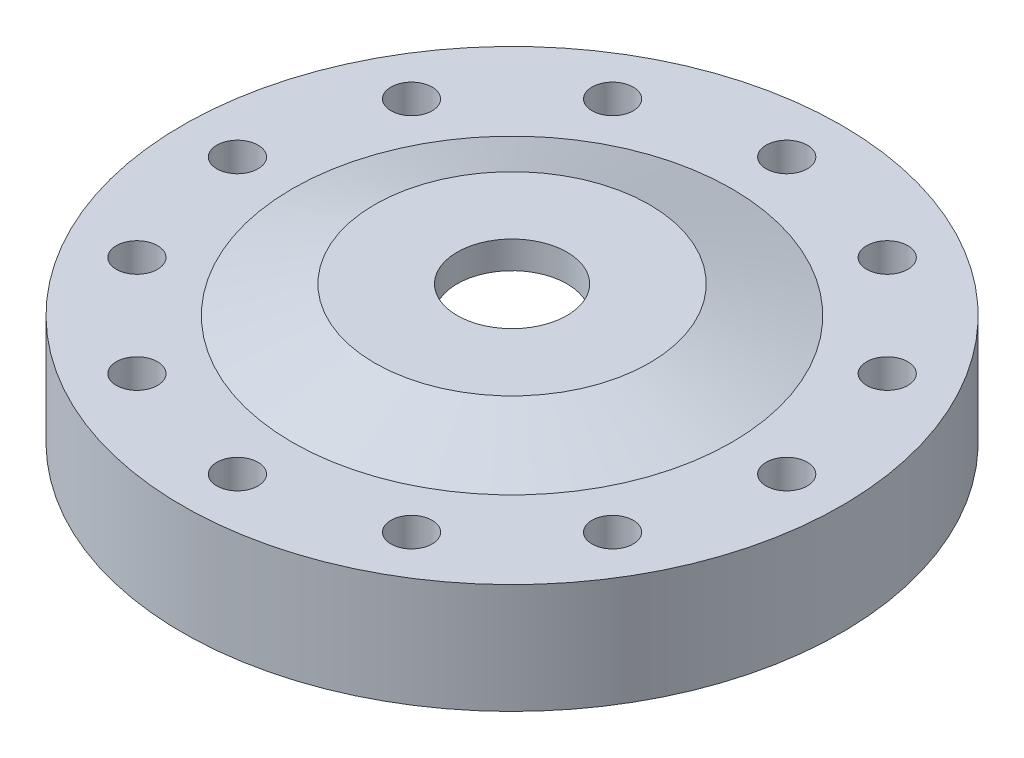
ISO-10303-21;
HEADER;
FILE_DESCRIPTION(('STEP AP214'),'2;1');
FILE_NAME('part.step','',(''),(''),'','','');
FILE_SCHEMA(('AUTOMOTIVE_DESIGN { 1 0 10303 214 1 1 1 1 }'));
ENDSEC;
DATA;
#1=APPLICATION_CONTEXT('core data for automotive mechanical design processes');
#2=APPLICATION_PROTOCOL_DEFINITION('international standard','automotive_design',2000,#1);
#3=PRODUCT_CONTEXT('',#1,'mechanical');
#4=PRODUCT('Part','Part','',(#3));
#5=PRODUCT_RELATED_PRODUCT_CATEGORY('part','',(#4));
#6=PRODUCT_DEFINITION_FORMATION('','',#4);
#7=PRODUCT_DEFINITION_CONTEXT('part definition',#1,'design');
#8=PRODUCT_DEFINITION('design','',#6,#7);
#9=PRODUCT_DEFINITION_SHAPE('','',#8);
#10=(LENGTH_UNIT() NAMED_UNIT(*) SI_UNIT(.MILLI.,.METRE.));
#11=(NAMED_UNIT(*) PLANE_ANGLE_UNIT() SI_UNIT($,.RADIAN.));
#12=(NAMED_UNIT(*) SI_UNIT($,.STERADIAN.) SOLID_ANGLE_UNIT());
#13=UNCERTAINTY_MEASURE_WITH_UNIT(LENGTH_MEASURE(1.E-05),#10,'distance_accuracy_value','');
#14=(GEOMETRIC_REPRESENTATION_CONTEXT(3) GLOBAL_UNCERTAINTY_ASSIGNED_CONTEXT((#13)) GLOBAL_UNIT_ASSIGNED_CONTEXT((#10,
#11,#12)) REPRESENTATION_CONTEXT('',''));
#15=CARTESIAN_POINT('',(0.,0.,0.));
#16=DIRECTION('',(0.,0.,1.));
#17=DIRECTION('',(1.,0.,0.));
#18=AXIS2_PLACEMENT_3D('',#15,#16,#17);
#19=CARTESIAN_POINT('',(0.,-1.5875,0.));
#20=DIRECTION('',(0.,-1.,0.));
#21=DIRECTION('',(0.,0.,-1.));
#22=AXIS2_PLACEMENT_3D('',#19,#20,#21);
#23=CYLINDRICAL_SURFACE('',#22,55.1307);
#24=CARTESIAN_POINT('',(0.,2.032,0.));
#25=DIRECTION('',(0.,-1.,0.));
#26=DIRECTION('',(0.,0.,-1.));
#27=AXIS2_PLACEMENT_3D('',#24,#25,#26);
#28=CIRCLE('',#27,55.1307);
#29=CARTESIAN_POINT('',(0.,2.032,-55.1307));
#30=VERTEX_POINT('',#29);
#31=EDGE_CURVE('E111',#30,#30,#28,.T.);
#32=ORIENTED_EDGE('',*,*,#31,.F.);
#33=EDGE_LOOP('',(#32));
#34=FACE_BOUND('',#33,.T.);
#35=CARTESIAN_POINT('',(0.,0.,0.));
#36=DIRECTION('',(0.,-1.,0.));
#37=DIRECTION('',(0.,0.,-1.));
#38=AXIS2_PLACEMENT_3D('',#35,#36,#37);
#39=CIRCLE('',#38,55.1307);
#40=CARTESIAN_POINT('',(0.,0.,-55.1307));
#41=VERTEX_POINT('',#40);
#42=EDGE_CURVE('E10',#41,#41,#39,.T.);
#43=ORIENTED_EDGE('',*,*,#42,.T.);
#44=EDGE_LOOP('',(#43));
#45=FACE_BOUND('',#44,.T.);
#46=ADVANCED_FACE('F37',(#34,#45),#23,.F.);
#47=CARTESIAN_POINT('',(-55.1307,0.,0.));
#48=DIRECTION('',(0.,1.,0.));
#49=DIRECTION('',(0.,0.,1.));
#50=AXIS2_PLACEMENT_3D('',#47,#48,#49);
#51=PLANE('',#50);
#52=CARTESIAN_POINT('',(-54.9926131403123,0.,-31.7499999999993));
#53=DIRECTION('',(0.,1.,0.));
#54=DIRECTION('',(0.,0.,1.));
#55=AXIS2_PLACEMENT_3D('',#52,#53,#54);
#56=CIRCLE('',#55,4.76249999999999);
#57=CARTESIAN_POINT('',(-54.9926131403123,0.,-26.9874999999993));
#58=VERTEX_POINT('',#57);
#59=EDGE_CURVE('E334',#58,#58,#56,.T.);
#60=ORIENTED_EDGE('',*,*,#59,.T.);
#61=EDGE_LOOP('',(#60));
#62=FACE_BOUND('',#61,.T.);
#63=CARTESIAN_POINT('',(-31.7500000000006,0.,-54.9926131403115));
#64=DIRECTION('',(0.,1.,0.));
#65=DIRECTION('',(0.,0.,1.));
#66=AXIS2_PLACEMENT_3D('',#63,#64,#65);
#67=CIRCLE('',#66,4.76249999999999);
#68=CARTESIAN_POINT('',(-31.7500000000006,0.,-50.2301131403115));
#69=VERTEX_POINT('',#68);
#70=EDGE_CURVE('E341',#69,#69,#67,.T.);
#71=ORIENTED_EDGE('',*,*,#70,.T.);
#72=EDGE_LOOP('',(#71));
#73=FACE_BOUND('',#72,.T.);
#74=CARTESIAN_POINT('',(-6.65127195049617E-13,0.,-63.5));
#75=DIRECTION('',(0.,1.,0.));
#76=DIRECTION('',(0.,0.,1.));
#77=AXIS2_PLACEMENT_3D('',#74,#75,#76);
#78=CIRCLE('',#77,4.76249999999999);
#79=CARTESIAN_POINT('',(-6.65127195049617E-13,0.,-58.7375));
#80=VERTEX_POINT('',#79);
#81=EDGE_CURVE('E352',#80,#80,#78,.T.);
#82=ORIENTED_EDGE('',*,*,#81,.T.);
#83=EDGE_LOOP('',(#82));
#84=FACE_BOUND('',#83,.T.);
#85=CARTESIAN_POINT('',(31.7499999999995,0.,-54.9926131403121));
#86=DIRECTION('',(0.,1.,0.));
#87=DIRECTION('',(0.,0.,1.));
#88=AXIS2_PLACEMENT_3D('',#85,#86,#87);
#89=CIRCLE('',#88,4.76249999999999);
#90=CARTESIAN_POINT('',(31.7499999999995,0.,-50.2301131403122));
#91=VERTEX_POINT('',#90);
#92=EDGE_CURVE('E360',#91,#91,#89,.T.);
#93=ORIENTED_EDGE('',*,*,#92,.T.);
#94=EDGE_LOOP('',(#93));
#95=FACE_BOUND('',#94,.T.);
#96=CARTESIAN_POINT('',(54.9926131403116,0.,-31.7500000000005));
#97=DIRECTION('',(0.,1.,0.));
#98=DIRECTION('',(0.,0.,1.));
#99=AXIS2_PLACEMENT_3D('',#96,#97,#98);
#100=CIRCLE('',#99,4.76249999999999);
#101=CARTESIAN_POINT('',(54.9926131403116,0.,-26.9875000000005));
#102=VERTEX_POINT('',#101);
#103=EDGE_CURVE('E367',#102,#102,#100,.T.);
#104=ORIENTED_EDGE('',*,*,#103,.T.);
#105=EDGE_LOOP('',(#104));
#106=FACE_BOUND('',#105,.T.);
#107=CARTESIAN_POINT('',(63.5,0.,0.));
#108=DIRECTION('',(0.,1.,0.));
#109=DIRECTION('',(0.,0.,1.));
#110=AXIS2_PLACEMENT_3D('',#107,#108,#109);
#111=CIRCLE('',#110,4.76249999999999);
#112=CARTESIAN_POINT('',(63.5,0.,4.76249999999999));
#113=VERTEX_POINT('',#112);
#114=EDGE_CURVE('E40',#113,#113,#111,.T.);
#115=ORIENTED_EDGE('',*,*,#114,.T.);
#116=EDGE_LOOP('',(#115));
#117=FACE_BOUND('',#116,.T.);
#118=CARTESIAN_POINT('',(54.992613140312,0.,31.7499999999997));
#119=DIRECTION('',(0.,1.,0.));
#120=DIRECTION('',(0.,0.,1.));
#121=AXIS2_PLACEMENT_3D('',#118,#119,#120);
#122=CIRCLE('',#121,4.76249999999999);
#123=CARTESIAN_POINT('',(54.992613140312,0.,36.5124999999997));
#124=VERTEX_POINT('',#123);
#125=EDGE_CURVE('E65',#124,#124,#122,.T.);
#126=ORIENTED_EDGE('',*,*,#125,.T.);
#127=EDGE_LOOP('',(#126));
#128=FACE_BOUND('',#127,.T.);
#129=CARTESIAN_POINT('',(31.7500000000003,0.,54.9926131403117));
#130=DIRECTION('',(0.,1.,0.));
#131=DIRECTION('',(0.,0.,1.));
#132=AXIS2_PLACEMENT_3D('',#129,#130,#131);
#133=CIRCLE('',#132,4.76249999999999);
#134=CARTESIAN_POINT('',(31.7500000000003,0.,59.7551131403117));
#135=VERTEX_POINT('',#134);
#136=EDGE_CURVE('E75',#135,#135,#133,.T.);
#137=ORIENTED_EDGE('',*,*,#136,.T.);
#138=EDGE_LOOP('',(#137));
#139=FACE_BOUND('',#138,.T.);
#140=CARTESIAN_POINT('',(2.21709065016539E-13,0.,63.5));
#141=DIRECTION('',(0.,1.,0.));
#142=DIRECTION('',(0.,0.,1.));
#143=AXIS2_PLACEMENT_3D('',#140,#141,#142);
#144=CIRCLE('',#143,4.76249999999999);
#145=CARTESIAN_POINT('',(2.21709065016539E-13,0.,68.2625));
#146=VERTEX_POINT('',#145);
#147=EDGE_CURVE('E61',#146,#146,#144,.T.);
#148=ORIENTED_EDGE('',*,*,#147,.T.);
#149=EDGE_LOOP('',(#148));
#150=FACE_BOUND('',#149,.T.);
#151=CARTESIAN_POINT('',(-31.7499999999999,0.,54.9926131403119));
#152=DIRECTION('',(0.,1.,0.));
#153=DIRECTION('',(0.,0.,1.));
#154=AXIS2_PLACEMENT_3D('',#151,#152,#153);
#155=CIRCLE('',#154,4.76249999999999);
#156=CARTESIAN_POINT('',(-31.7499999999999,0.,59.7551131403119));
#157=VERTEX_POINT('',#156);
#158=EDGE_CURVE('E55',#157,#157,#155,.T.);
#159=ORIENTED_EDGE('',*,*,#158,.T.);
#160=EDGE_LOOP('',(#159));
#161=FACE_BOUND('',#160,.T.);
#162=CARTESIAN_POINT('',(-54.9926131403118,0.,31.7500000000001));
#163=DIRECTION('',(0.,1.,0.));
#164=DIRECTION('',(0.,0.,1.));
#165=AXIS2_PLACEMENT_3D('',#162,#163,#164);
#166=CIRCLE('',#165,4.76249999999999);
#167=CARTESIAN_POINT('',(-54.9926131403118,0.,36.5125000000001));
#168=VERTEX_POINT('',#167);
#169=EDGE_CURVE('E99',#168,#168,#166,.T.);
#170=ORIENTED_EDGE('',*,*,#169,.T.);
#171=EDGE_LOOP('',(#170));
#172=FACE_BOUND('',#171,.T.);
#173=CARTESIAN_POINT('',(-63.5,0.,0.));
#174=DIRECTION('',(0.,1.,0.));
#175=DIRECTION('',(0.,0.,1.));
#176=AXIS2_PLACEMENT_3D('',#173,#174,#175);
#177=CIRCLE('',#176,4.76249999999999);
#178=CARTESIAN_POINT('',(-63.5,0.,4.76249999999999));
#179=VERTEX_POINT('',#178);
#180=EDGE_CURVE('E107',#179,#179,#177,.T.);
#181=ORIENTED_EDGE('',*,*,#180,.T.);
#182=EDGE_LOOP('',(#181));
#183=FACE_BOUND('',#182,.T.);
#184=ORIENTED_EDGE('',*,*,#42,.F.);
#185=EDGE_LOOP('',(#184));
#186=FACE_BOUND('',#185,.T.);
#187=CARTESIAN_POINT('',(0.,0.,0.));
#188=DIRECTION('',(0.,-1.,0.));
#189=DIRECTION('',(0.,0.,-1.));
#190=AXIS2_PLACEMENT_3D('',#187,#188,#189);
#191=CIRCLE('',#190,76.2);
#192=CARTESIAN_POINT('',(0.,0.,-76.2));
#193=VERTEX_POINT('',#192);
#194=EDGE_CURVE('E45',#193,#193,#191,.T.);
#195=ORIENTED_EDGE('',*,*,#194,.T.);
#196=EDGE_LOOP('',(#195));
#197=FACE_BOUND('',#196,.T.);
#198=ADVANCED_FACE('F269',(#62,#73,#84,#95,#106,#117,#128,#139,#150,#161,#172,#183,#186,#197),
#51,.F.);
#199=CARTESIAN_POINT('',(0.,-1.5875,0.));
#200=DIRECTION('',(0.,-1.,0.));
#201=DIRECTION('',(0.,0.,-1.));
#202=AXIS2_PLACEMENT_3D('',#199,#200,#201);
#203=CYLINDRICAL_SURFACE('',#202,76.2);
#204=ORIENTED_EDGE('',*,*,#194,.F.);
#205=EDGE_LOOP('',(#204));
#206=FACE_BOUND('',#205,.T.);
#207=CARTESIAN_POINT('',(0.,25.4,0.));
#208=DIRECTION('',(0.,-1.,0.));
#209=DIRECTION('',(0.,0.,-1.));
#210=AXIS2_PLACEMENT_3D('',#207,#208,#209);
#211=CIRCLE('',#210,76.2);
#212=CARTESIAN_POINT('',(0.,25.4,-76.2));
#213=VERTEX_POINT('',#212);
#214=EDGE_CURVE('E51',#213,#213,#211,.T.);
#215=ORIENTED_EDGE('',*,*,#214,.T.);
#216=EDGE_LOOP('',(#215));
#217=FACE_BOUND('',#216,.T.);
#218=ADVANCED_FACE('F174',(#206,#217),#203,.T.);
#219=CARTESIAN_POINT('',(-76.2,25.4,0.));
#220=DIRECTION('',(0.,-1.,0.));
#221=DIRECTION('',(0.,0.,-1.));
#222=AXIS2_PLACEMENT_3D('',#219,#220,#221);
#223=PLANE('',#222);
#224=CARTESIAN_POINT('',(-54.9926131403123,25.4,-31.7499999999993));
#225=DIRECTION('',(0.,1.,0.));
#226=DIRECTION('',(0.,0.,1.));
#227=AXIS2_PLACEMENT_3D('',#224,#225,#226);
#228=CIRCLE('',#227,4.76249999999999);
#229=CARTESIAN_POINT('',(-54.9926131403123,25.4,-26.9874999999993));
#230=VERTEX_POINT('',#229);
#231=EDGE_CURVE('E332',#230,#230,#228,.T.);
#232=ORIENTED_EDGE('',*,*,#231,.F.);
#233=EDGE_LOOP('',(#232));
#234=FACE_BOUND('',#233,.T.);
#235=CARTESIAN_POINT('',(-31.7500000000006,25.4,-54.9926131403115));
#236=DIRECTION('',(0.,1.,0.));
#237=DIRECTION('',(0.,0.,1.));
#238=AXIS2_PLACEMENT_3D('',#235,#236,#237);
#239=CIRCLE('',#238,4.76249999999999);
#240=CARTESIAN_POINT('',(-31.7500000000006,25.4,-50.2301131403115));
#241=VERTEX_POINT('',#240);
#242=EDGE_CURVE('E336',#241,#241,#239,.T.);
#243=ORIENTED_EDGE('',*,*,#242,.F.);
#244=EDGE_LOOP('',(#243));
#245=FACE_BOUND('',#244,.T.);
#246=CARTESIAN_POINT('',(-6.65127195049617E-13,25.4,-63.5));
#247=DIRECTION('',(0.,1.,0.));
#248=DIRECTION('',(0.,0.,1.));
#249=AXIS2_PLACEMENT_3D('',#246,#247,#248);
#250=CIRCLE('',#249,4.76249999999999);
#251=CARTESIAN_POINT('',(-6.65127195049617E-13,25.4,-58.7375));
#252=VERTEX_POINT('',#251);
#253=EDGE_CURVE('E348',#252,#252,#250,.T.);
#254=ORIENTED_EDGE('',*,*,#253,.F.);
#255=EDGE_LOOP('',(#254));
#256=FACE_BOUND('',#255,.T.);
#257=CARTESIAN_POINT('',(31.7499999999995,25.4,-54.9926131403121));
#258=DIRECTION('',(0.,1.,0.));
#259=DIRECTION('',(0.,0.,1.));
#260=AXIS2_PLACEMENT_3D('',#257,#258,#259);
#261=CIRCLE('',#260,4.76249999999999);
#262=CARTESIAN_POINT('',(31.7499999999995,25.4,-50.2301131403122));
#263=VERTEX_POINT('',#262);
#264=EDGE_CURVE('E356',#263,#263,#261,.T.);
#265=ORIENTED_EDGE('',*,*,#264,.F.);
#266=EDGE_LOOP('',(#265));
#267=FACE_BOUND('',#266,.T.);
#268=CARTESIAN_POINT('',(54.9926131403116,25.4,-31.7500000000005));
#269=DIRECTION('',(0.,1.,0.));
#270=DIRECTION('',(0.,0.,1.));
#271=AXIS2_PLACEMENT_3D('',#268,#269,#270);
#272=CIRCLE('',#271,4.76249999999999);
#273=CARTESIAN_POINT('',(54.9926131403116,25.4,-26.9875000000005));
#274=VERTEX_POINT('',#273);
#275=EDGE_CURVE('E364',#274,#274,#272,.T.);
#276=ORIENTED_EDGE('',*,*,#275,.F.);
#277=EDGE_LOOP('',(#276));
#278=FACE_BOUND('',#277,.T.);
#279=CARTESIAN_POINT('',(63.5,25.4,0.));
#280=DIRECTION('',(0.,1.,0.));
#281=DIRECTION('',(0.,0.,1.));
#282=AXIS2_PLACEMENT_3D('',#279,#280,#281);
#283=CIRCLE('',#282,4.76249999999999);
#284=CARTESIAN_POINT('',(63.5,25.4,4.76249999999999));
#285=VERTEX_POINT('',#284);
#286=EDGE_CURVE('E83',#285,#285,#283,.T.);
#287=ORIENTED_EDGE('',*,*,#286,.F.);
#288=EDGE_LOOP('',(#287));
#289=FACE_BOUND('',#288,.T.);
#290=CARTESIAN_POINT('',(54.992613140312,25.4,31.7499999999997));
#291=DIRECTION('',(0.,1.,0.));
#292=DIRECTION('',(0.,0.,1.));
#293=AXIS2_PLACEMENT_3D('',#290,#291,#292);
#294=CIRCLE('',#293,4.76249999999999);
#295=CARTESIAN_POINT('',(54.992613140312,25.4,36.5124999999997));
#296=VERTEX_POINT('',#295);
#297=EDGE_CURVE('E69',#296,#296,#294,.T.);
#298=ORIENTED_EDGE('',*,*,#297,.F.);
#299=EDGE_LOOP('',(#298));
#300=FACE_BOUND('',#299,.T.);
#301=CARTESIAN_POINT('',(31.7500000000003,25.4,54.9926131403117));
#302=DIRECTION('',(0.,1.,0.));
#303=DIRECTION('',(0.,0.,1.));
#304=AXIS2_PLACEMENT_3D('',#301,#302,#303);
#305=CIRCLE('',#304,4.76249999999999);
#306=CARTESIAN_POINT('',(31.7500000000003,25.4,59.7551131403117));
#307=VERTEX_POINT('',#306);
#308=EDGE_CURVE('E68',#307,#307,#305,.T.);
#309=ORIENTED_EDGE('',*,*,#308,.F.);
#310=EDGE_LOOP('',(#309));
#311=FACE_BOUND('',#310,.T.);
#312=CARTESIAN_POINT('',(2.21709065016539E-13,25.4,63.5));
#313=DIRECTION('',(0.,1.,0.));
#314=DIRECTION('',(0.,0.,1.));
#315=AXIS2_PLACEMENT_3D('',#312,#313,#314);
#316=CIRCLE('',#315,4.76249999999999);
#317=CARTESIAN_POINT('',(2.21709065016539E-13,25.4,68.2625));
#318=VERTEX_POINT('',#317);
#319=EDGE_CURVE('E64',#318,#318,#316,.T.);
#320=ORIENTED_EDGE('',*,*,#319,.F.);
#321=EDGE_LOOP('',(#320));
#322=FACE_BOUND('',#321,.T.);
#323=CARTESIAN_POINT('',(-31.7499999999999,25.4,54.9926131403119));
#324=DIRECTION('',(0.,1.,0.));
#325=DIRECTION('',(0.,0.,1.));
#326=AXIS2_PLACEMENT_3D('',#323,#324,#325);
#327=CIRCLE('',#326,4.76249999999999);
#328=CARTESIAN_POINT('',(-31.7499999999999,25.4,59.7551131403119));
#329=VERTEX_POINT('',#328);
#330=EDGE_CURVE('E60',#329,#329,#327,.T.);
#331=ORIENTED_EDGE('',*,*,#330,.F.);
#332=EDGE_LOOP('',(#331));
#333=FACE_BOUND('',#332,.T.);
#334=CARTESIAN_POINT('',(-54.9926131403118,25.4,31.7500000000001));
#335=DIRECTION('',(0.,1.,0.));
#336=DIRECTION('',(0.,0.,1.));
#337=AXIS2_PLACEMENT_3D('',#334,#335,#336);
#338=CIRCLE('',#337,4.76249999999999);
#339=CARTESIAN_POINT('',(-54.9926131403118,25.4,36.5125000000001));
#340=VERTEX_POINT('',#339);
#341=EDGE_CURVE('E59',#340,#340,#338,.T.);
#342=ORIENTED_EDGE('',*,*,#341,.F.);
#343=EDGE_LOOP('',(#342));
#344=FACE_BOUND('',#343,.T.);
#345=CARTESIAN_POINT('',(-63.5,25.4,0.));
#346=DIRECTION('',(0.,1.,0.));
#347=DIRECTION('',(0.,0.,1.));
#348=AXIS2_PLACEMENT_3D('',#345,#346,#347);
#349=CIRCLE('',#348,4.76249999999999);
#350=CARTESIAN_POINT('',(-63.5,25.4,4.76249999999999));
#351=VERTEX_POINT('',#350);
#352=EDGE_CURVE('E103',#351,#351,#349,.T.);
#353=ORIENTED_EDGE('',*,*,#352,.F.);
#354=EDGE_LOOP('',(#353));
#355=FACE_BOUND('',#354,.T.);
#356=ORIENTED_EDGE('',*,*,#214,.F.);
#357=EDGE_LOOP('',(#356));
#358=FACE_BOUND('',#357,.T.);
#359=CARTESIAN_POINT('',(0.,25.4,0.));
#360=DIRECTION('',(0.,-1.,0.));
#361=DIRECTION('',(0.,0.,-1.));
#362=AXIS2_PLACEMENT_3D('',#359,#360,#361);
#363=CIRCLE('',#362,50.8);
#364=CARTESIAN_POINT('',(0.,25.4,-50.8));
#365=VERTEX_POINT('',#364);
#366=EDGE_CURVE('E167',#365,#365,#363,.T.);
#367=ORIENTED_EDGE('',*,*,#366,.T.);
#368=EDGE_LOOP('',(#367));
#369=FACE_BOUND('',#368,.T.);
#370=ADVANCED_FACE('F176',(#234,#245,#256,#267,#278,#289,#300,#311,#322,#333,#344,#355,#358,
#369),#223,.F.);
#371=CARTESIAN_POINT('',(0.,31.75,0.));
#372=DIRECTION('',(0.,-1.,0.));
#373=DIRECTION('',(0.,0.,-1.));
#374=AXIS2_PLACEMENT_3D('',#371,#372,#373);
#375=CONICAL_SURFACE('',#374,31.75,1.24904577239825);
#376=ORIENTED_EDGE('',*,*,#366,.F.);
#377=EDGE_LOOP('',(#376));
#378=FACE_BOUND('',#377,.T.);
#379=CARTESIAN_POINT('',(0.,31.75,0.));
#380=DIRECTION('',(0.,-1.,0.));
#381=DIRECTION('',(0.,0.,-1.));
#382=AXIS2_PLACEMENT_3D('',#379,#380,#381);
#383=CIRCLE('',#382,31.75);
#384=CARTESIAN_POINT('',(0.,31.75,-31.75));
#385=VERTEX_POINT('',#384);
#386=EDGE_CURVE('E163',#385,#385,#383,.T.);
#387=ORIENTED_EDGE('',*,*,#386,.T.);
#388=EDGE_LOOP('',(#387));
#389=FACE_BOUND('',#388,.T.);
#390=ADVANCED_FACE('F179',(#378,#389),#375,.T.);
#391=CARTESIAN_POINT('',(-31.75,31.75,0.));
#392=DIRECTION('',(0.,-1.,0.));
#393=DIRECTION('',(0.,0.,-1.));
#394=AXIS2_PLACEMENT_3D('',#391,#392,#393);
#395=PLANE('',#394);
#396=ORIENTED_EDGE('',*,*,#386,.F.);
#397=EDGE_LOOP('',(#396));
#398=FACE_BOUND('',#397,.T.);
#399=CARTESIAN_POINT('',(0.,31.75,0.));
#400=DIRECTION('',(0.,-1.,0.));
#401=DIRECTION('',(0.,0.,-1.));
#402=AXIS2_PLACEMENT_3D('',#399,#400,#401);
#403=CIRCLE('',#402,12.7);
#404=CARTESIAN_POINT('',(0.,31.75,-12.7));
#405=VERTEX_POINT('',#404);
#406=EDGE_CURVE('E159',#405,#405,#403,.T.);
#407=ORIENTED_EDGE('',*,*,#406,.T.);
#408=EDGE_LOOP('',(#407));
#409=FACE_BOUND('',#408,.T.);
#410=ADVANCED_FACE('F186',(#398,#409),#395,.F.);
#411=CARTESIAN_POINT('',(0.,-1.5875,0.));
#412=DIRECTION('',(0.,-1.,0.));
#413=DIRECTION('',(0.,0.,-1.));
#414=AXIS2_PLACEMENT_3D('',#411,#412,#413);
#415=CYLINDRICAL_SURFACE('',#414,12.7);
#416=ORIENTED_EDGE('',*,*,#406,.F.);
#417=EDGE_LOOP('',(#416));
#418=FACE_BOUND('',#417,.T.);
#419=CARTESIAN_POINT('',(0.,25.4,0.));
#420=DIRECTION('',(0.,-1.,0.));
#421=DIRECTION('',(0.,0.,-1.));
#422=AXIS2_PLACEMENT_3D('',#419,#420,#421);
#423=CIRCLE('',#422,12.7);
#424=CARTESIAN_POINT('',(0.,25.4,-12.7));
#425=VERTEX_POINT('',#424);
#426=EDGE_CURVE('E155',#425,#425,#423,.T.);
#427=ORIENTED_EDGE('',*,*,#426,.T.);
#428=EDGE_LOOP('',(#427));
#429=FACE_BOUND('',#428,.T.);
#430=ADVANCED_FACE('F192',(#418,#429),#415,.F.);
#431=CARTESIAN_POINT('',(0.,15.875,0.));
#432=DIRECTION('',(0.,-1.,0.));
#433=DIRECTION('',(0.,0.,-1.));
#434=AXIS2_PLACEMENT_3D('',#431,#432,#433);
#435=CONICAL_SURFACE('',#434,31.75,1.10714871779409);
#436=ORIENTED_EDGE('',*,*,#426,.F.);
#437=EDGE_LOOP('',(#436));
#438=FACE_BOUND('',#437,.T.);
#439=CARTESIAN_POINT('',(0.,15.875,0.));
#440=DIRECTION('',(0.,-1.,0.));
#441=DIRECTION('',(0.,0.,-1.));
#442=AXIS2_PLACEMENT_3D('',#439,#440,#441);
#443=CIRCLE('',#442,31.75);
#444=CARTESIAN_POINT('',(0.,15.875,-31.75));
#445=VERTEX_POINT('',#444);
#446=EDGE_CURVE('E151',#445,#445,#443,.T.);
#447=ORIENTED_EDGE('',*,*,#446,.T.);
#448=EDGE_LOOP('',(#447));
#449=FACE_BOUND('',#448,.T.);
#450=ADVANCED_FACE('F198',(#438,#449),#435,.F.);
#451=CARTESIAN_POINT('',(0.,-1.5875,0.));
#452=DIRECTION('',(0.,-1.,0.));
#453=DIRECTION('',(0.,0.,-1.));
#454=AXIS2_PLACEMENT_3D('',#451,#452,#453);
#455=CYLINDRICAL_SURFACE('',#454,31.75);
#456=ORIENTED_EDGE('',*,*,#446,.F.);
#457=EDGE_LOOP('',(#456));
#458=FACE_BOUND('',#457,.T.);
#459=CARTESIAN_POINT('',(0.,12.7,0.));
#460=DIRECTION('',(0.,-1.,0.));
#461=DIRECTION('',(0.,0.,-1.));
#462=AXIS2_PLACEMENT_3D('',#459,#460,#461);
#463=CIRCLE('',#462,31.75);
#464=CARTESIAN_POINT('',(0.,12.7,-31.75));
#465=VERTEX_POINT('',#464);
#466=EDGE_CURVE('E147',#465,#465,#463,.T.);
#467=ORIENTED_EDGE('',*,*,#466,.T.);
#468=EDGE_LOOP('',(#467));
#469=FACE_BOUND('',#468,.T.);
#470=ADVANCED_FACE('F204',(#458,#469),#455,.F.);
#471=CARTESIAN_POINT('',(-33.3375,12.7,0.));
#472=DIRECTION('',(0.,1.,0.));
#473=DIRECTION('',(0.,0.,1.));
#474=AXIS2_PLACEMENT_3D('',#471,#472,#473);
#475=PLANE('',#474);
#476=ORIENTED_EDGE('',*,*,#466,.F.);
#477=EDGE_LOOP('',(#476));
#478=FACE_BOUND('',#477,.T.);
#479=CARTESIAN_POINT('',(0.,12.7,0.));
#480=DIRECTION('',(0.,-1.,0.));
#481=DIRECTION('',(0.,0.,-1.));
#482=AXIS2_PLACEMENT_3D('',#479,#480,#481);
#483=CIRCLE('',#482,33.3375);
#484=CARTESIAN_POINT('',(0.,12.7,-33.3375));
#485=VERTEX_POINT('',#484);
#486=EDGE_CURVE('E143',#485,#485,#483,.T.);
#487=ORIENTED_EDGE('',*,*,#486,.T.);
#488=EDGE_LOOP('',(#487));
#489=FACE_BOUND('',#488,.T.);
#490=ADVANCED_FACE('F210',(#478,#489),#475,.F.);
#491=CARTESIAN_POINT('',(0.,-1.5875,0.));
#492=DIRECTION('',(0.,-1.,0.));
#493=DIRECTION('',(0.,0.,-1.));
#494=AXIS2_PLACEMENT_3D('',#491,#492,#493);
#495=CYLINDRICAL_SURFACE('',#494,33.3375);
#496=ORIENTED_EDGE('',*,*,#486,.F.);
#497=EDGE_LOOP('',(#496));
#498=FACE_BOUND('',#497,.T.);
#499=CARTESIAN_POINT('',(0.,14.732,0.));
#500=DIRECTION('',(0.,-1.,0.));
#501=DIRECTION('',(0.,0.,-1.));
#502=AXIS2_PLACEMENT_3D('',#499,#500,#501);
#503=CIRCLE('',#502,33.3375);
#504=CARTESIAN_POINT('',(0.,14.732,-33.3375));
#505=VERTEX_POINT('',#504);
#506=EDGE_CURVE('E139',#505,#505,#503,.T.);
#507=ORIENTED_EDGE('',*,*,#506,.T.);
#508=EDGE_LOOP('',(#507));
#509=FACE_BOUND('',#508,.T.);
#510=ADVANCED_FACE('F216',(#498,#509),#495,.T.);
#511=CARTESIAN_POINT('',(-36.0807,14.732,0.));
#512=DIRECTION('',(0.,1.,0.));
#513=DIRECTION('',(0.,0.,1.));
#514=AXIS2_PLACEMENT_3D('',#511,#512,#513);
#515=PLANE('',#514);
#516=ORIENTED_EDGE('',*,*,#506,.F.);
#517=EDGE_LOOP('',(#516));
#518=FACE_BOUND('',#517,.T.);
#519=CARTESIAN_POINT('',(0.,14.732,0.));
#520=DIRECTION('',(0.,-1.,0.));
#521=DIRECTION('',(0.,0.,-1.));
#522=AXIS2_PLACEMENT_3D('',#519,#520,#521);
#523=CIRCLE('',#522,36.0807);
#524=CARTESIAN_POINT('',(0.,14.732,-36.0807));
#525=VERTEX_POINT('',#524);
#526=EDGE_CURVE('E135',#525,#525,#523,.T.);
#527=ORIENTED_EDGE('',*,*,#526,.T.);
#528=EDGE_LOOP('',(#527));
#529=FACE_BOUND('',#528,.T.);
#530=ADVANCED_FACE('F222',(#518,#529),#515,.F.);
#531=CARTESIAN_POINT('',(0.,-1.5875,0.));
#532=DIRECTION('',(0.,-1.,0.));
#533=DIRECTION('',(0.,0.,-1.));
#534=AXIS2_PLACEMENT_3D('',#531,#532,#533);
#535=CYLINDRICAL_SURFACE('',#534,36.0807);
#536=ORIENTED_EDGE('',*,*,#526,.F.);
#537=EDGE_LOOP('',(#536));
#538=FACE_BOUND('',#537,.T.);
#539=CARTESIAN_POINT('',(0.,12.7,0.));
#540=DIRECTION('',(0.,-1.,0.));
#541=DIRECTION('',(0.,0.,-1.));
#542=AXIS2_PLACEMENT_3D('',#539,#540,#541);
#543=CIRCLE('',#542,36.0807);
#544=CARTESIAN_POINT('',(0.,12.7,-36.0807));
#545=VERTEX_POINT('',#544);
#546=EDGE_CURVE('E131',#545,#545,#543,.T.);
#547=ORIENTED_EDGE('',*,*,#546,.T.);
#548=EDGE_LOOP('',(#547));
#549=FACE_BOUND('',#548,.T.);
#550=ADVANCED_FACE('F228',(#538,#549),#535,.F.);
#551=CARTESIAN_POINT('',(-36.0807,12.7,0.));
#552=DIRECTION('',(0.,1.,0.));
#553=DIRECTION('',(0.,0.,1.));
#554=AXIS2_PLACEMENT_3D('',#551,#552,#553);
#555=PLANE('',#554);
#556=ORIENTED_EDGE('',*,*,#546,.F.);
#557=EDGE_LOOP('',(#556));
#558=FACE_BOUND('',#557,.T.);
#559=CARTESIAN_POINT('',(0.,12.7,0.));
#560=DIRECTION('',(0.,-1.,0.));
#561=DIRECTION('',(0.,0.,-1.));
#562=AXIS2_PLACEMENT_3D('',#559,#560,#561);
#563=CIRCLE('',#562,50.8);
#564=CARTESIAN_POINT('',(0.,12.7,-50.8));
#565=VERTEX_POINT('',#564);
#566=EDGE_CURVE('E127',#565,#565,#563,.T.);
#567=ORIENTED_EDGE('',*,*,#566,.T.);
#568=EDGE_LOOP('',(#567));
#569=FACE_BOUND('',#568,.T.);
#570=ADVANCED_FACE('F234',(#558,#569),#555,.F.);
#571=CARTESIAN_POINT('',(0.,-1.5875,0.));
#572=DIRECTION('',(0.,-1.,0.));
#573=DIRECTION('',(0.,0.,-1.));
#574=AXIS2_PLACEMENT_3D('',#571,#572,#573);
#575=CYLINDRICAL_SURFACE('',#574,50.8);
#576=ORIENTED_EDGE('',*,*,#566,.F.);
#577=EDGE_LOOP('',(#576));
#578=FACE_BOUND('',#577,.T.);
#579=CARTESIAN_POINT('',(0.,0.,0.));
#580=DIRECTION('',(0.,-1.,0.));
#581=DIRECTION('',(0.,0.,-1.));
#582=AXIS2_PLACEMENT_3D('',#579,#580,#581);
#583=CIRCLE('',#582,50.8);
#584=CARTESIAN_POINT('',(0.,0.,-50.8));
#585=VERTEX_POINT('',#584);
#586=EDGE_CURVE('E123',#585,#585,#583,.T.);
#587=ORIENTED_EDGE('',*,*,#586,.T.);
#588=EDGE_LOOP('',(#587));
#589=FACE_BOUND('',#588,.T.);
#590=ADVANCED_FACE('F240',(#578,#589),#575,.F.);
#591=CARTESIAN_POINT('',(-50.8,0.,0.));
#592=DIRECTION('',(0.,1.,0.));
#593=DIRECTION('',(0.,0.,1.));
#594=AXIS2_PLACEMENT_3D('',#591,#592,#593);
#595=PLANE('',#594);
#596=ORIENTED_EDGE('',*,*,#586,.F.);
#597=EDGE_LOOP('',(#596));
#598=FACE_BOUND('',#597,.T.);
#599=CARTESIAN_POINT('',(0.,0.,0.));
#600=DIRECTION('',(0.,-1.,0.));
#601=DIRECTION('',(0.,0.,-1.));
#602=AXIS2_PLACEMENT_3D('',#599,#600,#601);
#603=CIRCLE('',#602,52.3875);
#604=CARTESIAN_POINT('',(0.,0.,-52.3875));
#605=VERTEX_POINT('',#604);
#606=EDGE_CURVE('E119',#605,#605,#603,.T.);
#607=ORIENTED_EDGE('',*,*,#606,.T.);
#608=EDGE_LOOP('',(#607));
#609=FACE_BOUND('',#608,.T.);
#610=ADVANCED_FACE('F246',(#598,#609),#595,.F.);
#611=CARTESIAN_POINT('',(0.,-1.5875,0.));
#612=DIRECTION('',(0.,-1.,0.));
#613=DIRECTION('',(0.,0.,-1.));
#614=AXIS2_PLACEMENT_3D('',#611,#612,#613);
#615=CYLINDRICAL_SURFACE('',#614,52.3875);
#616=ORIENTED_EDGE('',*,*,#606,.F.);
#617=EDGE_LOOP('',(#616));
#618=FACE_BOUND('',#617,.T.);
#619=CARTESIAN_POINT('',(0.,2.032,0.));
#620=DIRECTION('',(0.,-1.,0.));
#621=DIRECTION('',(0.,0.,-1.));
#622=AXIS2_PLACEMENT_3D('',#619,#620,#621);
#623=CIRCLE('',#622,52.3875);
#624=CARTESIAN_POINT('',(0.,2.032,-52.3875));
#625=VERTEX_POINT('',#624);
#626=EDGE_CURVE('E115',#625,#625,#623,.T.);
#627=ORIENTED_EDGE('',*,*,#626,.T.);
#628=EDGE_LOOP('',(#627));
#629=FACE_BOUND('',#628,.T.);
#630=ADVANCED_FACE('F252',(#618,#629),#615,.T.);
#631=CARTESIAN_POINT('',(-52.3875,2.032,0.));
#632=DIRECTION('',(0.,1.,0.));
#633=DIRECTION('',(0.,0.,1.));
#634=AXIS2_PLACEMENT_3D('',#631,#632,#633);
#635=PLANE('',#634);
#636=ORIENTED_EDGE('',*,*,#626,.F.);
#637=EDGE_LOOP('',(#636));
#638=FACE_BOUND('',#637,.T.);
#639=ORIENTED_EDGE('',*,*,#31,.T.);
#640=EDGE_LOOP('',(#639));
#641=FACE_BOUND('',#640,.T.);
#642=ADVANCED_FACE('F258',(#638,#641),#635,.F.);
#643=CARTESIAN_POINT('',(-63.5,25.4,0.));
#644=DIRECTION('',(0.,1.,0.));
#645=DIRECTION('',(0.,0.,1.));
#646=AXIS2_PLACEMENT_3D('',#643,#644,#645);
#647=CYLINDRICAL_SURFACE('',#646,4.76249999999999);
#648=ORIENTED_EDGE('',*,*,#352,.T.);
#649=EDGE_LOOP('',(#648));
#650=FACE_BOUND('',#649,.T.);
#651=ORIENTED_EDGE('',*,*,#180,.F.);
#652=EDGE_LOOP('',(#651));
#653=FACE_BOUND('',#652,.T.);
#654=ADVANCED_FACE('F264',(#650,#653),#647,.F.);
#655=CARTESIAN_POINT('',(-54.9926131403118,25.4,31.7500000000001));
#656=DIRECTION('',(0.,1.,0.));
#657=DIRECTION('',(0.,0.,1.));
#658=AXIS2_PLACEMENT_3D('',#655,#656,#657);
#659=CYLINDRICAL_SURFACE('',#658,4.76249999999999);
#660=ORIENTED_EDGE('',*,*,#341,.T.);
#661=EDGE_LOOP('',(#660));
#662=FACE_BOUND('',#661,.T.);
#663=ORIENTED_EDGE('',*,*,#169,.F.);
#664=EDGE_LOOP('',(#663));
#665=FACE_BOUND('',#664,.T.);
#666=ADVANCED_FACE('F284',(#662,#665),#659,.F.);
#667=CARTESIAN_POINT('',(-31.7499999999999,25.4,54.9926131403119));
#668=DIRECTION('',(0.,1.,0.));
#669=DIRECTION('',(0.,0.,1.));
#670=AXIS2_PLACEMENT_3D('',#667,#668,#669);
#671=CYLINDRICAL_SURFACE('',#670,4.76249999999999);
#672=ORIENTED_EDGE('',*,*,#330,.T.);
#673=EDGE_LOOP('',(#672));
#674=FACE_BOUND('',#673,.T.);
#675=ORIENTED_EDGE('',*,*,#158,.F.);
#676=EDGE_LOOP('',(#675));
#677=FACE_BOUND('',#676,.T.);
#678=ADVANCED_FACE('F288',(#674,#677),#671,.F.);
#679=CARTESIAN_POINT('',(2.21709065016539E-13,25.4,63.5));
#680=DIRECTION('',(0.,1.,0.));
#681=DIRECTION('',(0.,0.,1.));
#682=AXIS2_PLACEMENT_3D('',#679,#680,#681);
#683=CYLINDRICAL_SURFACE('',#682,4.76249999999999);
#684=ORIENTED_EDGE('',*,*,#319,.T.);
#685=EDGE_LOOP('',(#684));
#686=FACE_BOUND('',#685,.T.);
#687=ORIENTED_EDGE('',*,*,#147,.F.);
#688=EDGE_LOOP('',(#687));
#689=FACE_BOUND('',#688,.T.);
#690=ADVANCED_FACE('F292',(#686,#689),#683,.F.);
#691=CARTESIAN_POINT('',(31.7500000000003,25.4,54.9926131403117));
#692=DIRECTION('',(0.,1.,0.));
#693=DIRECTION('',(0.,0.,1.));
#694=AXIS2_PLACEMENT_3D('',#691,#692,#693);
#695=CYLINDRICAL_SURFACE('',#694,4.76249999999999);
#696=ORIENTED_EDGE('',*,*,#308,.T.);
#697=EDGE_LOOP('',(#696));
#698=FACE_BOUND('',#697,.T.);
#699=ORIENTED_EDGE('',*,*,#136,.F.);
#700=EDGE_LOOP('',(#699));
#701=FACE_BOUND('',#700,.T.);
#702=ADVANCED_FACE('F296',(#698,#701),#695,.F.);
#703=CARTESIAN_POINT('',(54.992613140312,25.4,31.7499999999997));
#704=DIRECTION('',(0.,1.,0.));
#705=DIRECTION('',(0.,0.,1.));
#706=AXIS2_PLACEMENT_3D('',#703,#704,#705);
#707=CYLINDRICAL_SURFACE('',#706,4.76249999999999);
#708=ORIENTED_EDGE('',*,*,#297,.T.);
#709=EDGE_LOOP('',(#708));
#710=FACE_BOUND('',#709,.T.);
#711=ORIENTED_EDGE('',*,*,#125,.F.);
#712=EDGE_LOOP('',(#711));
#713=FACE_BOUND('',#712,.T.);
#714=ADVANCED_FACE('F300',(#710,#713),#707,.F.);
#715=CARTESIAN_POINT('',(63.5,25.4,0.));
#716=DIRECTION('',(0.,1.,0.));
#717=DIRECTION('',(0.,0.,1.));
#718=AXIS2_PLACEMENT_3D('',#715,#716,#717);
#719=CYLINDRICAL_SURFACE('',#718,4.76249999999999);
#720=ORIENTED_EDGE('',*,*,#286,.T.);
#721=EDGE_LOOP('',(#720));
#722=FACE_BOUND('',#721,.T.);
#723=ORIENTED_EDGE('',*,*,#114,.F.);
#724=EDGE_LOOP('',(#723));
#725=FACE_BOUND('',#724,.T.);
#726=ADVANCED_FACE('F304',(#722,#725),#719,.F.);
#727=CARTESIAN_POINT('',(54.9926131403116,25.4,-31.7500000000005));
#728=DIRECTION('',(0.,1.,0.));
#729=DIRECTION('',(0.,0.,1.));
#730=AXIS2_PLACEMENT_3D('',#727,#728,#729);
#731=CYLINDRICAL_SURFACE('',#730,4.76249999999999);
#732=ORIENTED_EDGE('',*,*,#275,.T.);
#733=EDGE_LOOP('',(#732));
#734=FACE_BOUND('',#733,.T.);
#735=ORIENTED_EDGE('',*,*,#103,.F.);
#736=EDGE_LOOP('',(#735));
#737=FACE_BOUND('',#736,.T.);
#738=ADVANCED_FACE('F307',(#734,#737),#731,.F.);
#739=CARTESIAN_POINT('',(31.7499999999995,25.4,-54.9926131403121));
#740=DIRECTION('',(0.,1.,0.));
#741=DIRECTION('',(0.,0.,1.));
#742=AXIS2_PLACEMENT_3D('',#739,#740,#741);
#743=CYLINDRICAL_SURFACE('',#742,4.76249999999999);
#744=ORIENTED_EDGE('',*,*,#264,.T.);
#745=EDGE_LOOP('',(#744));
#746=FACE_BOUND('',#745,.T.);
#747=ORIENTED_EDGE('',*,*,#92,.F.);
#748=EDGE_LOOP('',(#747));
#749=FACE_BOUND('',#748,.T.);
#750=ADVANCED_FACE('F311',(#746,#749),#743,.F.);
#751=CARTESIAN_POINT('',(-6.65127195049617E-13,25.4,-63.5));
#752=DIRECTION('',(0.,1.,0.));
#753=DIRECTION('',(0.,0.,1.));
#754=AXIS2_PLACEMENT_3D('',#751,#752,#753);
#755=CYLINDRICAL_SURFACE('',#754,4.76249999999999);
#756=ORIENTED_EDGE('',*,*,#253,.T.);
#757=EDGE_LOOP('',(#756));
#758=FACE_BOUND('',#757,.T.);
#759=ORIENTED_EDGE('',*,*,#81,.F.);
#760=EDGE_LOOP('',(#759));
#761=FACE_BOUND('',#760,.T.);
#762=ADVANCED_FACE('F315',(#758,#761),#755,.F.);
#763=CARTESIAN_POINT('',(-31.7500000000006,25.4,-54.9926131403115));
#764=DIRECTION('',(0.,1.,0.));
#765=DIRECTION('',(0.,0.,1.));
#766=AXIS2_PLACEMENT_3D('',#763,#764,#765);
#767=CYLINDRICAL_SURFACE('',#766,4.76249999999999);
#768=ORIENTED_EDGE('',*,*,#242,.T.);
#769=EDGE_LOOP('',(#768));
#770=FACE_BOUND('',#769,.T.);
#771=ORIENTED_EDGE('',*,*,#70,.F.);
#772=EDGE_LOOP('',(#771));
#773=FACE_BOUND('',#772,.T.);
#774=ADVANCED_FACE('F319',(#770,#773),#767,.F.);
#775=CARTESIAN_POINT('',(-54.9926131403123,25.4,-31.7499999999993));
#776=DIRECTION('',(0.,1.,0.));
#777=DIRECTION('',(0.,0.,1.));
#778=AXIS2_PLACEMENT_3D('',#775,#776,#777);
#779=CYLINDRICAL_SURFACE('',#778,4.76249999999999);
#780=ORIENTED_EDGE('',*,*,#231,.T.);
#781=EDGE_LOOP('',(#780));
#782=FACE_BOUND('',#781,.T.);
#783=ORIENTED_EDGE('',*,*,#59,.F.);
#784=EDGE_LOOP('',(#783));
#785=FACE_BOUND('',#784,.T.);
#786=ADVANCED_FACE('F323',(#782,#785),#779,.F.);
#787=CLOSED_SHELL('',(#46,#198,#218,#370,#390,#410,#430,#450,#470,#490,#510,#530,#550,#570,#590,
#610,#630,#642,#654,#666,#678,#690,#702,#714,#726,#738,#750,#762,#774,#786));
#788=MANIFOLD_SOLID_BREP('B2',#787);
#789=ADVANCED_BREP_SHAPE_REPRESENTATION('',(#18,#788),#14);
#790=SHAPE_DEFINITION_REPRESENTATION(#9,#789);
ENDSEC;
END-ISO-10303-21;
